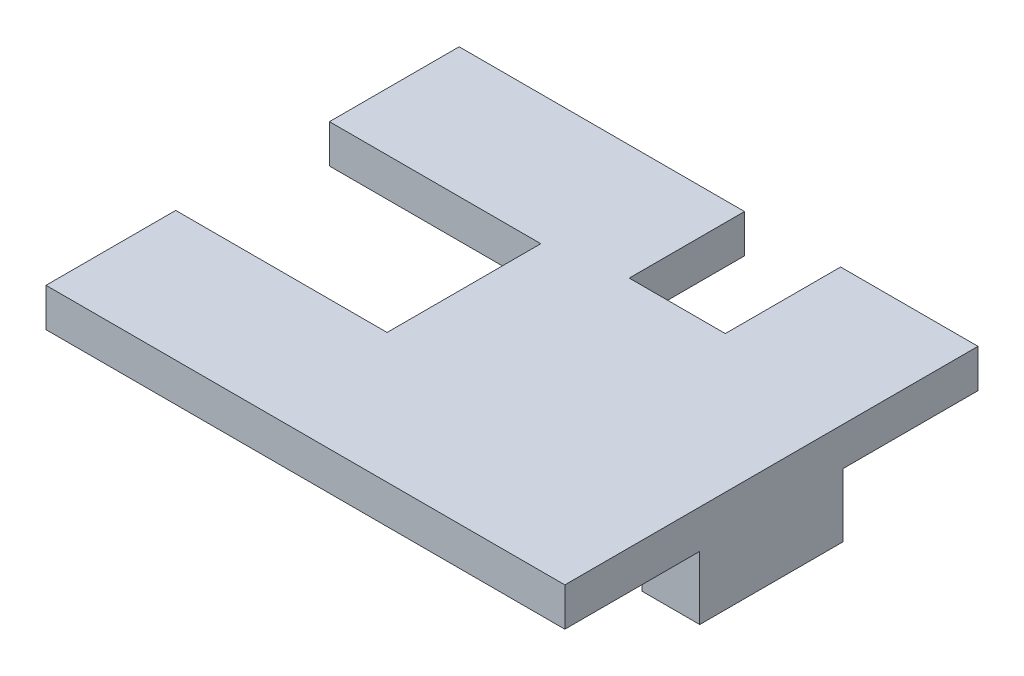
ISO-10303-21;
HEADER;
FILE_DESCRIPTION(('STEP AP214'),'2;1');
FILE_NAME('part.step','',(''),(''),'','','');
FILE_SCHEMA(('AUTOMOTIVE_DESIGN { 1 0 10303 214 1 1 1 1 }'));
ENDSEC;
DATA;
#1=APPLICATION_CONTEXT('core data for automotive mechanical design processes');
#2=APPLICATION_PROTOCOL_DEFINITION('international standard','automotive_design',2000,#1);
#3=PRODUCT_CONTEXT('',#1,'mechanical');
#4=PRODUCT('Part','Part','',(#3));
#5=PRODUCT_RELATED_PRODUCT_CATEGORY('part','',(#4));
#6=PRODUCT_DEFINITION_FORMATION('','',#4);
#7=PRODUCT_DEFINITION_CONTEXT('part definition',#1,'design');
#8=PRODUCT_DEFINITION('design','',#6,#7);
#9=PRODUCT_DEFINITION_SHAPE('','',#8);
#10=(LENGTH_UNIT() NAMED_UNIT(*) SI_UNIT(.MILLI.,.METRE.));
#11=(NAMED_UNIT(*) PLANE_ANGLE_UNIT() SI_UNIT($,.RADIAN.));
#12=(NAMED_UNIT(*) SI_UNIT($,.STERADIAN.) SOLID_ANGLE_UNIT());
#13=UNCERTAINTY_MEASURE_WITH_UNIT(LENGTH_MEASURE(1.E-05),#10,'distance_accuracy_value','');
#14=(GEOMETRIC_REPRESENTATION_CONTEXT(3) GLOBAL_UNCERTAINTY_ASSIGNED_CONTEXT((#13)) GLOBAL_UNIT_ASSIGNED_CONTEXT((#10,
#11,#12)) REPRESENTATION_CONTEXT('',''));
#15=CARTESIAN_POINT('',(0.,0.,0.));
#16=DIRECTION('',(0.,0.,1.));
#17=DIRECTION('',(1.,0.,0.));
#18=AXIS2_PLACEMENT_3D('',#15,#16,#17);
#19=CARTESIAN_POINT('',(0.,0.,0.));
#20=DIRECTION('',(0.,1.,0.));
#21=DIRECTION('',(0.,0.,1.));
#22=AXIS2_PLACEMENT_3D('',#19,#20,#21);
#23=PLANE('',#22);
#24=DIRECTION('',(1.,0.,0.));
#25=VECTOR('',#24,1.);
#26=CARTESIAN_POINT('',(7.96634899281713,0.,-2.94133617535299));
#27=LINE('',#26,#25);
#28=CARTESIAN_POINT('',(4.96634899281713,0.,-2.94133617535299));
#29=VERTEX_POINT('',#28);
#30=CARTESIAN_POINT('',(7.96634899281712,0.,-2.941336175353));
#31=VERTEX_POINT('',#30);
#32=EDGE_CURVE('E50',#29,#31,#27,.T.);
#33=ORIENTED_EDGE('',*,*,#32,.F.);
#34=DIRECTION('',(0.,0.,-1.));
#35=VECTOR('',#34,1.);
#36=CARTESIAN_POINT('',(4.96634899281713,0.,4.518663824647));
#37=LINE('',#36,#35);
#38=CARTESIAN_POINT('',(4.96634899281713,0.,4.518663824647));
#39=VERTEX_POINT('',#38);
#40=EDGE_CURVE('E315',#39,#29,#37,.T.);
#41=ORIENTED_EDGE('',*,*,#40,.F.);
#42=DIRECTION('',(-1.,0.,0.));
#43=VECTOR('',#42,1.);
#44=CARTESIAN_POINT('',(7.96634899281713,0.,4.518663824647));
#45=LINE('',#44,#43);
#46=CARTESIAN_POINT('',(7.96634899281713,0.,4.518663824647));
#47=VERTEX_POINT('',#46);
#48=EDGE_CURVE('E317',#47,#39,#45,.T.);
#49=ORIENTED_EDGE('',*,*,#48,.F.);
#50=DIRECTION('',(0.,0.,-1.));
#51=VECTOR('',#50,1.);
#52=CARTESIAN_POINT('',(7.96634899281712,0.,-9.96133617535299));
#53=LINE('',#52,#51);
#54=CARTESIAN_POINT('',(7.96634899281713,0.,11.538663824647));
#55=VERTEX_POINT('',#54);
#56=EDGE_CURVE('E171',#55,#47,#53,.T.);
#57=ORIENTED_EDGE('',*,*,#56,.F.);
#58=DIRECTION('',(1.,0.,0.));
#59=VECTOR('',#58,1.);
#60=CARTESIAN_POINT('',(-19.0336510071829,0.,11.538663824647));
#61=LINE('',#60,#59);
#62=CARTESIAN_POINT('',(-19.0336510071829,0.,11.538663824647));
#63=VERTEX_POINT('',#62);
#64=EDGE_CURVE('E215',#63,#55,#61,.T.);
#65=ORIENTED_EDGE('',*,*,#64,.F.);
#66=DIRECTION('',(0.,0.,1.));
#67=VECTOR('',#66,1.);
#68=CARTESIAN_POINT('',(-19.0336510071829,0.,4.78866382464701));
#69=LINE('',#68,#67);
#70=CARTESIAN_POINT('',(-19.0336510071829,0.,4.78866382464701));
#71=VERTEX_POINT('',#70);
#72=EDGE_CURVE('E213',#71,#63,#69,.T.);
#73=ORIENTED_EDGE('',*,*,#72,.F.);
#74=DIRECTION('',(-1.,0.,0.));
#75=VECTOR('',#74,1.);
#76=CARTESIAN_POINT('',(-19.0336510071829,0.,4.78866382464701));
#77=LINE('',#76,#75);
#78=CARTESIAN_POINT('',(-8.03365100718288,0.,4.78866382464701));
#79=VERTEX_POINT('',#78);
#80=EDGE_CURVE('E211',#79,#71,#77,.T.);
#81=ORIENTED_EDGE('',*,*,#80,.F.);
#82=DIRECTION('',(0.,0.,1.));
#83=VECTOR('',#82,1.);
#84=CARTESIAN_POINT('',(-8.03365100718288,0.,-3.21133617535299));
#85=LINE('',#84,#83);
#86=CARTESIAN_POINT('',(-8.03365100718288,0.,-3.21133617535299));
#87=VERTEX_POINT('',#86);
#88=EDGE_CURVE('E209',#87,#79,#85,.T.);
#89=ORIENTED_EDGE('',*,*,#88,.F.);
#90=DIRECTION('',(1.,0.,0.));
#91=VECTOR('',#90,1.);
#92=CARTESIAN_POINT('',(-19.0336510071829,0.,-3.21133617535299));
#93=LINE('',#92,#91);
#94=CARTESIAN_POINT('',(-19.0336510071829,0.,-3.21133617535299));
#95=VERTEX_POINT('',#94);
#96=EDGE_CURVE('E175',#95,#87,#93,.T.);
#97=ORIENTED_EDGE('',*,*,#96,.F.);
#98=DIRECTION('',(0.,0.,1.));
#99=VECTOR('',#98,1.);
#100=CARTESIAN_POINT('',(-19.0336510071829,0.,-9.96133617535299));
#101=LINE('',#100,#99);
#102=CARTESIAN_POINT('',(-19.0336510071829,0.,-9.96133617535299));
#103=VERTEX_POINT('',#102);
#104=EDGE_CURVE('E172',#103,#95,#101,.T.);
#105=ORIENTED_EDGE('',*,*,#104,.F.);
#106=DIRECTION('',(-1.,0.,0.));
#107=VECTOR('',#106,1.);
#108=CARTESIAN_POINT('',(-19.0336510071829,0.,-9.96133617535299));
#109=LINE('',#108,#107);
#110=CARTESIAN_POINT('',(-4.18365100718288,0.,-9.96133617535299));
#111=VERTEX_POINT('',#110);
#112=EDGE_CURVE('E185',#111,#103,#109,.T.);
#113=ORIENTED_EDGE('',*,*,#112,.F.);
#114=DIRECTION('',(0.,0.,-1.));
#115=VECTOR('',#114,1.);
#116=CARTESIAN_POINT('',(-4.18365100718288,0.,-9.96133617535299));
#117=LINE('',#116,#115);
#118=CARTESIAN_POINT('',(-4.18365100718288,0.,-3.96133617535299));
#119=VERTEX_POINT('',#118);
#120=EDGE_CURVE('E224',#119,#111,#117,.T.);
#121=ORIENTED_EDGE('',*,*,#120,.F.);
#122=DIRECTION('',(-1.,0.,0.));
#123=VECTOR('',#122,1.);
#124=CARTESIAN_POINT('',(-4.18365100718288,0.,-3.96133617535299));
#125=LINE('',#124,#123);
#126=CARTESIAN_POINT('',(0.816348992817122,0.,-3.96133617535299));
#127=VERTEX_POINT('',#126);
#128=EDGE_CURVE('E222',#127,#119,#125,.T.);
#129=ORIENTED_EDGE('',*,*,#128,.F.);
#130=DIRECTION('',(0.,0.,1.));
#131=VECTOR('',#130,1.);
#132=CARTESIAN_POINT('',(0.816348992817122,0.,-9.96133617535299));
#133=LINE('',#132,#131);
#134=CARTESIAN_POINT('',(0.816348992817122,0.,-9.96133617535299));
#135=VERTEX_POINT('',#134);
#136=EDGE_CURVE('E220',#135,#127,#133,.T.);
#137=ORIENTED_EDGE('',*,*,#136,.F.);
#138=DIRECTION('',(-1.,0.,0.));
#139=VECTOR('',#138,1.);
#140=CARTESIAN_POINT('',(0.816348992817122,0.,-9.96133617535299));
#141=LINE('',#140,#139);
#142=CARTESIAN_POINT('',(7.96634899281712,0.,-9.96133617535299));
#143=VERTEX_POINT('',#142);
#144=EDGE_CURVE('E218',#143,#135,#141,.T.);
#145=ORIENTED_EDGE('',*,*,#144,.F.);
#146=EDGE_CURVE('E55',#31,#143,#53,.T.);
#147=ORIENTED_EDGE('',*,*,#146,.F.);
#148=EDGE_LOOP('',(#33,#41,#49,#57,#65,#73,#81,#89,#97,#105,#113,#121,#129,#137,#145,#147));
#149=FACE_BOUND('',#148,.T.);
#150=ADVANCED_FACE('F35',(#149),#23,.F.);
#151=CARTESIAN_POINT('',(-19.0336510071829,2.,-9.96133617535299));
#152=DIRECTION('',(1.,0.,0.));
#153=DIRECTION('',(0.,0.,-1.));
#154=AXIS2_PLACEMENT_3D('',#151,#152,#153);
#155=PLANE('',#154);
#156=ORIENTED_EDGE('',*,*,#104,.T.);
#157=DIRECTION('',(0.,-1.,0.));
#158=VECTOR('',#157,1.);
#159=CARTESIAN_POINT('',(-19.0336510071829,2.,-3.21133617535299));
#160=LINE('',#159,#158);
#161=CARTESIAN_POINT('',(-19.0336510071829,2.,-3.21133617535299));
#162=VERTEX_POINT('',#161);
#163=EDGE_CURVE('E11',#162,#95,#160,.T.);
#164=ORIENTED_EDGE('',*,*,#163,.F.);
#165=DIRECTION('',(0.,0.,1.));
#166=VECTOR('',#165,1.);
#167=CARTESIAN_POINT('',(-19.0336510071829,2.,-9.96133617535299));
#168=LINE('',#167,#166);
#169=CARTESIAN_POINT('',(-19.0336510071829,2.,-9.96133617535299));
#170=VERTEX_POINT('',#169);
#171=EDGE_CURVE('E181',#170,#162,#168,.T.);
#172=ORIENTED_EDGE('',*,*,#171,.F.);
#173=DIRECTION('',(0.,-1.,0.));
#174=VECTOR('',#173,1.);
#175=CARTESIAN_POINT('',(-19.0336510071829,2.,-9.96133617535299));
#176=LINE('',#175,#174);
#177=EDGE_CURVE('E206',#170,#103,#176,.T.);
#178=ORIENTED_EDGE('',*,*,#177,.T.);
#179=EDGE_LOOP('',(#156,#164,#172,#178));
#180=FACE_BOUND('',#179,.T.);
#181=ADVANCED_FACE('F37',(#180),#155,.F.);
#182=CARTESIAN_POINT('',(-19.0336510071829,2.,-3.21133617535299));
#183=DIRECTION('',(0.,0.,-1.));
#184=DIRECTION('',(-1.,0.,0.));
#185=AXIS2_PLACEMENT_3D('',#182,#183,#184);
#186=PLANE('',#185);
#187=ORIENTED_EDGE('',*,*,#96,.T.);
#188=DIRECTION('',(0.,-1.,0.));
#189=VECTOR('',#188,1.);
#190=CARTESIAN_POINT('',(-8.03365100718288,2.,-3.21133617535299));
#191=LINE('',#190,#189);
#192=CARTESIAN_POINT('',(-8.03365100718288,2.,-3.21133617535299));
#193=VERTEX_POINT('',#192);
#194=EDGE_CURVE('E43',#193,#87,#191,.T.);
#195=ORIENTED_EDGE('',*,*,#194,.F.);
#196=DIRECTION('',(1.,0.,0.));
#197=VECTOR('',#196,1.);
#198=CARTESIAN_POINT('',(-19.0336510071829,2.,-3.21133617535299));
#199=LINE('',#198,#197);
#200=EDGE_CURVE('E184',#162,#193,#199,.T.);
#201=ORIENTED_EDGE('',*,*,#200,.F.);
#202=ORIENTED_EDGE('',*,*,#163,.T.);
#203=EDGE_LOOP('',(#187,#195,#201,#202));
#204=FACE_BOUND('',#203,.T.);
#205=ADVANCED_FACE('F280',(#204),#186,.F.);
#206=CARTESIAN_POINT('',(-8.03365100718288,2.,-3.21133617535299));
#207=DIRECTION('',(1.,0.,0.));
#208=DIRECTION('',(0.,0.,-1.));
#209=AXIS2_PLACEMENT_3D('',#206,#207,#208);
#210=PLANE('',#209);
#211=ORIENTED_EDGE('',*,*,#88,.T.);
#212=DIRECTION('',(0.,-1.,0.));
#213=VECTOR('',#212,1.);
#214=CARTESIAN_POINT('',(-8.03365100718288,2.,4.78866382464701));
#215=LINE('',#214,#213);
#216=CARTESIAN_POINT('',(-8.03365100718288,2.,4.78866382464701));
#217=VERTEX_POINT('',#216);
#218=EDGE_CURVE('E252',#217,#79,#215,.T.);
#219=ORIENTED_EDGE('',*,*,#218,.F.);
#220=DIRECTION('',(0.,0.,1.));
#221=VECTOR('',#220,1.);
#222=CARTESIAN_POINT('',(-8.03365100718288,2.,-3.21133617535299));
#223=LINE('',#222,#221);
#224=EDGE_CURVE('E187',#193,#217,#223,.T.);
#225=ORIENTED_EDGE('',*,*,#224,.F.);
#226=ORIENTED_EDGE('',*,*,#194,.T.);
#227=EDGE_LOOP('',(#211,#219,#225,#226));
#228=FACE_BOUND('',#227,.T.);
#229=ADVANCED_FACE('F259',(#228),#210,.F.);
#230=CARTESIAN_POINT('',(-19.0336510071829,2.,4.78866382464701));
#231=DIRECTION('',(0.,0.,1.));
#232=DIRECTION('',(1.,0.,0.));
#233=AXIS2_PLACEMENT_3D('',#230,#231,#232);
#234=PLANE('',#233);
#235=ORIENTED_EDGE('',*,*,#80,.T.);
#236=DIRECTION('',(0.,-1.,0.));
#237=VECTOR('',#236,1.);
#238=CARTESIAN_POINT('',(-19.0336510071829,2.,4.78866382464701));
#239=LINE('',#238,#237);
#240=CARTESIAN_POINT('',(-19.0336510071829,2.,4.78866382464701));
#241=VERTEX_POINT('',#240);
#242=EDGE_CURVE('E249',#241,#71,#239,.T.);
#243=ORIENTED_EDGE('',*,*,#242,.F.);
#244=DIRECTION('',(-1.,0.,0.));
#245=VECTOR('',#244,1.);
#246=CARTESIAN_POINT('',(-19.0336510071829,2.,4.78866382464701));
#247=LINE('',#246,#245);
#248=EDGE_CURVE('E189',#217,#241,#247,.T.);
#249=ORIENTED_EDGE('',*,*,#248,.F.);
#250=ORIENTED_EDGE('',*,*,#218,.T.);
#251=EDGE_LOOP('',(#235,#243,#249,#250));
#252=FACE_BOUND('',#251,.T.);
#253=ADVANCED_FACE('F268',(#252),#234,.F.);
#254=CARTESIAN_POINT('',(-19.0336510071829,2.,4.78866382464701));
#255=DIRECTION('',(1.,0.,0.));
#256=DIRECTION('',(0.,0.,-1.));
#257=AXIS2_PLACEMENT_3D('',#254,#255,#256);
#258=PLANE('',#257);
#259=ORIENTED_EDGE('',*,*,#72,.T.);
#260=DIRECTION('',(0.,-1.,0.));
#261=VECTOR('',#260,1.);
#262=CARTESIAN_POINT('',(-19.0336510071829,2.,11.538663824647));
#263=LINE('',#262,#261);
#264=CARTESIAN_POINT('',(-19.0336510071829,2.,11.538663824647));
#265=VERTEX_POINT('',#264);
#266=EDGE_CURVE('E246',#265,#63,#263,.T.);
#267=ORIENTED_EDGE('',*,*,#266,.F.);
#268=DIRECTION('',(0.,0.,1.));
#269=VECTOR('',#268,1.);
#270=CARTESIAN_POINT('',(-19.0336510071829,2.,4.78866382464701));
#271=LINE('',#270,#269);
#272=EDGE_CURVE('E191',#241,#265,#271,.T.);
#273=ORIENTED_EDGE('',*,*,#272,.F.);
#274=ORIENTED_EDGE('',*,*,#242,.T.);
#275=EDGE_LOOP('',(#259,#267,#273,#274));
#276=FACE_BOUND('',#275,.T.);
#277=ADVANCED_FACE('F272',(#276),#258,.F.);
#278=CARTESIAN_POINT('',(-19.0336510071829,2.,11.538663824647));
#279=DIRECTION('',(0.,0.,-1.));
#280=DIRECTION('',(-1.,0.,0.));
#281=AXIS2_PLACEMENT_3D('',#278,#279,#280);
#282=PLANE('',#281);
#283=ORIENTED_EDGE('',*,*,#64,.T.);
#284=DIRECTION('',(0.,-1.,0.));
#285=VECTOR('',#284,1.);
#286=CARTESIAN_POINT('',(7.96634899281713,2.,11.538663824647));
#287=LINE('',#286,#285);
#288=CARTESIAN_POINT('',(7.96634899281713,2.,11.538663824647));
#289=VERTEX_POINT('',#288);
#290=EDGE_CURVE('E244',#289,#55,#287,.T.);
#291=ORIENTED_EDGE('',*,*,#290,.F.);
#292=DIRECTION('',(1.,0.,0.));
#293=VECTOR('',#292,1.);
#294=CARTESIAN_POINT('',(-19.0336510071829,2.,11.538663824647));
#295=LINE('',#294,#293);
#296=EDGE_CURVE('E193',#265,#289,#295,.T.);
#297=ORIENTED_EDGE('',*,*,#296,.F.);
#298=ORIENTED_EDGE('',*,*,#266,.T.);
#299=EDGE_LOOP('',(#283,#291,#297,#298));
#300=FACE_BOUND('',#299,.T.);
#301=ADVANCED_FACE('F351',(#300),#282,.F.);
#302=CARTESIAN_POINT('',(7.96634899281712,2.,-9.96133617535299));
#303=DIRECTION('',(-1.,0.,0.));
#304=DIRECTION('',(0.,0.,1.));
#305=AXIS2_PLACEMENT_3D('',#302,#303,#304);
#306=PLANE('',#305);
#307=ORIENTED_EDGE('',*,*,#56,.T.);
#308=DIRECTION('',(0.,1.,0.));
#309=VECTOR('',#308,1.);
#310=CARTESIAN_POINT('',(7.96634899281713,-3.3,4.518663824647));
#311=LINE('',#310,#309);
#312=CARTESIAN_POINT('',(7.96634899281713,-3.3,4.518663824647));
#313=VERTEX_POINT('',#312);
#314=EDGE_CURVE('E151',#313,#47,#311,.T.);
#315=ORIENTED_EDGE('',*,*,#314,.F.);
#316=DIRECTION('',(0.,0.,1.));
#317=VECTOR('',#316,1.);
#318=CARTESIAN_POINT('',(7.96634899281713,-3.3,4.518663824647));
#319=LINE('',#318,#317);
#320=CARTESIAN_POINT('',(7.96634899281713,-3.3,-2.94133617535299));
#321=VERTEX_POINT('',#320);
#322=EDGE_CURVE('E157',#321,#313,#319,.T.);
#323=ORIENTED_EDGE('',*,*,#322,.F.);
#324=DIRECTION('',(0.,1.,0.));
#325=VECTOR('',#324,1.);
#326=CARTESIAN_POINT('',(7.96634899281713,-3.3,-2.94133617535299));
#327=LINE('',#326,#325);
#328=EDGE_CURVE('E308',#321,#31,#327,.T.);
#329=ORIENTED_EDGE('',*,*,#328,.T.);
#330=ORIENTED_EDGE('',*,*,#146,.T.);
#331=DIRECTION('',(0.,-1.,0.));
#332=VECTOR('',#331,1.);
#333=CARTESIAN_POINT('',(7.96634899281712,2.,-9.96133617535299));
#334=LINE('',#333,#332);
#335=CARTESIAN_POINT('',(7.96634899281712,2.,-9.96133617535299));
#336=VERTEX_POINT('',#335);
#337=EDGE_CURVE('E241',#336,#143,#334,.T.);
#338=ORIENTED_EDGE('',*,*,#337,.F.);
#339=DIRECTION('',(0.,0.,-1.));
#340=VECTOR('',#339,1.);
#341=CARTESIAN_POINT('',(7.96634899281712,2.,-9.96133617535299));
#342=LINE('',#341,#340);
#343=EDGE_CURVE('E195',#289,#336,#342,.T.);
#344=ORIENTED_EDGE('',*,*,#343,.F.);
#345=ORIENTED_EDGE('',*,*,#290,.T.);
#346=EDGE_LOOP('',(#307,#315,#323,#329,#330,#338,#344,#345));
#347=FACE_BOUND('',#346,.T.);
#348=ADVANCED_FACE('F168',(#347),#306,.F.);
#349=CARTESIAN_POINT('',(0.816348992817122,2.,-9.96133617535299));
#350=DIRECTION('',(0.,0.,1.));
#351=DIRECTION('',(1.,0.,0.));
#352=AXIS2_PLACEMENT_3D('',#349,#350,#351);
#353=PLANE('',#352);
#354=ORIENTED_EDGE('',*,*,#144,.T.);
#355=DIRECTION('',(0.,-1.,0.));
#356=VECTOR('',#355,1.);
#357=CARTESIAN_POINT('',(0.816348992817122,2.,-9.96133617535299));
#358=LINE('',#357,#356);
#359=CARTESIAN_POINT('',(0.816348992817122,2.,-9.96133617535299));
#360=VERTEX_POINT('',#359);
#361=EDGE_CURVE('E238',#360,#135,#358,.T.);
#362=ORIENTED_EDGE('',*,*,#361,.F.);
#363=DIRECTION('',(-1.,0.,0.));
#364=VECTOR('',#363,1.);
#365=CARTESIAN_POINT('',(0.816348992817122,2.,-9.96133617535299));
#366=LINE('',#365,#364);
#367=EDGE_CURVE('E197',#336,#360,#366,.T.);
#368=ORIENTED_EDGE('',*,*,#367,.F.);
#369=ORIENTED_EDGE('',*,*,#337,.T.);
#370=EDGE_LOOP('',(#354,#362,#368,#369));
#371=FACE_BOUND('',#370,.T.);
#372=ADVANCED_FACE('F305',(#371),#353,.F.);
#373=CARTESIAN_POINT('',(0.816348992817122,2.,-9.96133617535299));
#374=DIRECTION('',(1.,0.,0.));
#375=DIRECTION('',(0.,0.,-1.));
#376=AXIS2_PLACEMENT_3D('',#373,#374,#375);
#377=PLANE('',#376);
#378=ORIENTED_EDGE('',*,*,#136,.T.);
#379=DIRECTION('',(0.,-1.,0.));
#380=VECTOR('',#379,1.);
#381=CARTESIAN_POINT('',(0.816348992817122,2.,-3.96133617535299));
#382=LINE('',#381,#380);
#383=CARTESIAN_POINT('',(0.816348992817122,2.,-3.96133617535299));
#384=VERTEX_POINT('',#383);
#385=EDGE_CURVE('E235',#384,#127,#382,.T.);
#386=ORIENTED_EDGE('',*,*,#385,.F.);
#387=DIRECTION('',(0.,0.,1.));
#388=VECTOR('',#387,1.);
#389=CARTESIAN_POINT('',(0.816348992817122,2.,-9.96133617535299));
#390=LINE('',#389,#388);
#391=EDGE_CURVE('E199',#360,#384,#390,.T.);
#392=ORIENTED_EDGE('',*,*,#391,.F.);
#393=ORIENTED_EDGE('',*,*,#361,.T.);
#394=EDGE_LOOP('',(#378,#386,#392,#393));
#395=FACE_BOUND('',#394,.T.);
#396=ADVANCED_FACE('F300',(#395),#377,.F.);
#397=CARTESIAN_POINT('',(-4.18365100718288,2.,-3.96133617535299));
#398=DIRECTION('',(0.,0.,1.));
#399=DIRECTION('',(1.,0.,0.));
#400=AXIS2_PLACEMENT_3D('',#397,#398,#399);
#401=PLANE('',#400);
#402=ORIENTED_EDGE('',*,*,#128,.T.);
#403=DIRECTION('',(0.,-1.,0.));
#404=VECTOR('',#403,1.);
#405=CARTESIAN_POINT('',(-4.18365100718288,2.,-3.96133617535299));
#406=LINE('',#405,#404);
#407=CARTESIAN_POINT('',(-4.18365100718288,2.,-3.96133617535299));
#408=VERTEX_POINT('',#407);
#409=EDGE_CURVE('E232',#408,#119,#406,.T.);
#410=ORIENTED_EDGE('',*,*,#409,.F.);
#411=DIRECTION('',(-1.,0.,0.));
#412=VECTOR('',#411,1.);
#413=CARTESIAN_POINT('',(-4.18365100718288,2.,-3.96133617535299));
#414=LINE('',#413,#412);
#415=EDGE_CURVE('E201',#384,#408,#414,.T.);
#416=ORIENTED_EDGE('',*,*,#415,.F.);
#417=ORIENTED_EDGE('',*,*,#385,.T.);
#418=EDGE_LOOP('',(#402,#410,#416,#417));
#419=FACE_BOUND('',#418,.T.);
#420=ADVANCED_FACE('F296',(#419),#401,.F.);
#421=CARTESIAN_POINT('',(-4.18365100718288,2.,-9.96133617535299));
#422=DIRECTION('',(-1.,0.,0.));
#423=DIRECTION('',(0.,0.,1.));
#424=AXIS2_PLACEMENT_3D('',#421,#422,#423);
#425=PLANE('',#424);
#426=ORIENTED_EDGE('',*,*,#120,.T.);
#427=DIRECTION('',(0.,-1.,0.));
#428=VECTOR('',#427,1.);
#429=CARTESIAN_POINT('',(-4.18365100718288,2.,-9.96133617535299));
#430=LINE('',#429,#428);
#431=CARTESIAN_POINT('',(-4.18365100718288,2.,-9.96133617535299));
#432=VERTEX_POINT('',#431);
#433=EDGE_CURVE('E229',#432,#111,#430,.T.);
#434=ORIENTED_EDGE('',*,*,#433,.F.);
#435=DIRECTION('',(0.,0.,-1.));
#436=VECTOR('',#435,1.);
#437=CARTESIAN_POINT('',(-4.18365100718288,2.,-9.96133617535299));
#438=LINE('',#437,#436);
#439=EDGE_CURVE('E203',#408,#432,#438,.T.);
#440=ORIENTED_EDGE('',*,*,#439,.F.);
#441=ORIENTED_EDGE('',*,*,#409,.T.);
#442=EDGE_LOOP('',(#426,#434,#440,#441));
#443=FACE_BOUND('',#442,.T.);
#444=ADVANCED_FACE('F292',(#443),#425,.F.);
#445=CARTESIAN_POINT('',(-19.0336510071829,2.,-9.96133617535299));
#446=DIRECTION('',(0.,0.,1.));
#447=DIRECTION('',(1.,0.,0.));
#448=AXIS2_PLACEMENT_3D('',#445,#446,#447);
#449=PLANE('',#448);
#450=ORIENTED_EDGE('',*,*,#112,.T.);
#451=ORIENTED_EDGE('',*,*,#177,.F.);
#452=DIRECTION('',(-1.,0.,0.));
#453=VECTOR('',#452,1.);
#454=CARTESIAN_POINT('',(-19.0336510071829,2.,-9.96133617535299));
#455=LINE('',#454,#453);
#456=EDGE_CURVE('E205',#432,#170,#455,.T.);
#457=ORIENTED_EDGE('',*,*,#456,.F.);
#458=ORIENTED_EDGE('',*,*,#433,.T.);
#459=EDGE_LOOP('',(#450,#451,#457,#458));
#460=FACE_BOUND('',#459,.T.);
#461=ADVANCED_FACE('F287',(#460),#449,.F.);
#462=CARTESIAN_POINT('',(0.,2.,0.));
#463=DIRECTION('',(0.,1.,0.));
#464=DIRECTION('',(0.,0.,1.));
#465=AXIS2_PLACEMENT_3D('',#462,#463,#464);
#466=PLANE('',#465);
#467=ORIENTED_EDGE('',*,*,#171,.T.);
#468=ORIENTED_EDGE('',*,*,#200,.T.);
#469=ORIENTED_EDGE('',*,*,#224,.T.);
#470=ORIENTED_EDGE('',*,*,#248,.T.);
#471=ORIENTED_EDGE('',*,*,#272,.T.);
#472=ORIENTED_EDGE('',*,*,#296,.T.);
#473=ORIENTED_EDGE('',*,*,#343,.T.);
#474=ORIENTED_EDGE('',*,*,#367,.T.);
#475=ORIENTED_EDGE('',*,*,#391,.T.);
#476=ORIENTED_EDGE('',*,*,#415,.T.);
#477=ORIENTED_EDGE('',*,*,#439,.T.);
#478=ORIENTED_EDGE('',*,*,#456,.T.);
#479=EDGE_LOOP('',(#467,#468,#469,#470,#471,#472,#473,#474,#475,#476,#477,#478));
#480=FACE_BOUND('',#479,.T.);
#481=ADVANCED_FACE('F276',(#480),#466,.T.);
#482=CARTESIAN_POINT('',(7.96634899281713,-3.3,4.518663824647));
#483=DIRECTION('',(0.,0.,-1.));
#484=DIRECTION('',(-1.,0.,0.));
#485=AXIS2_PLACEMENT_3D('',#482,#483,#484);
#486=PLANE('',#485);
#487=ORIENTED_EDGE('',*,*,#48,.T.);
#488=DIRECTION('',(0.,1.,0.));
#489=VECTOR('',#488,1.);
#490=CARTESIAN_POINT('',(4.96634899281713,-3.3,4.518663824647));
#491=LINE('',#490,#489);
#492=CARTESIAN_POINT('',(4.96634899281713,-3.3,4.518663824647));
#493=VERTEX_POINT('',#492);
#494=EDGE_CURVE('E153',#493,#39,#491,.T.);
#495=ORIENTED_EDGE('',*,*,#494,.F.);
#496=DIRECTION('',(-1.,0.,0.));
#497=VECTOR('',#496,1.);
#498=CARTESIAN_POINT('',(7.96634899281713,-3.3,4.518663824647));
#499=LINE('',#498,#497);
#500=EDGE_CURVE('E146',#313,#493,#499,.T.);
#501=ORIENTED_EDGE('',*,*,#500,.F.);
#502=ORIENTED_EDGE('',*,*,#314,.T.);
#503=EDGE_LOOP('',(#487,#495,#501,#502));
#504=FACE_BOUND('',#503,.T.);
#505=ADVANCED_FACE('F149',(#504),#486,.F.);
#506=CARTESIAN_POINT('',(4.96634899281713,-3.3,4.518663824647));
#507=DIRECTION('',(1.,0.,0.));
#508=DIRECTION('',(0.,0.,-1.));
#509=AXIS2_PLACEMENT_3D('',#506,#507,#508);
#510=PLANE('',#509);
#511=ORIENTED_EDGE('',*,*,#40,.T.);
#512=DIRECTION('',(0.,1.,0.));
#513=VECTOR('',#512,1.);
#514=CARTESIAN_POINT('',(4.96634899281713,-3.3,-2.94133617535299));
#515=LINE('',#514,#513);
#516=CARTESIAN_POINT('',(4.96634899281713,-3.3,-2.94133617535299));
#517=VERTEX_POINT('',#516);
#518=EDGE_CURVE('E177',#517,#29,#515,.T.);
#519=ORIENTED_EDGE('',*,*,#518,.F.);
#520=DIRECTION('',(0.,0.,-1.));
#521=VECTOR('',#520,1.);
#522=CARTESIAN_POINT('',(4.96634899281713,-3.3,4.518663824647));
#523=LINE('',#522,#521);
#524=EDGE_CURVE('E156',#493,#517,#523,.T.);
#525=ORIENTED_EDGE('',*,*,#524,.F.);
#526=ORIENTED_EDGE('',*,*,#494,.T.);
#527=EDGE_LOOP('',(#511,#519,#525,#526));
#528=FACE_BOUND('',#527,.T.);
#529=ADVANCED_FACE('F321',(#528),#510,.F.);
#530=CARTESIAN_POINT('',(7.96634899281713,-3.3,-2.94133617535299));
#531=DIRECTION('',(0.,0.,1.));
#532=DIRECTION('',(1.,0.,0.));
#533=AXIS2_PLACEMENT_3D('',#530,#531,#532);
#534=PLANE('',#533);
#535=ORIENTED_EDGE('',*,*,#32,.T.);
#536=ORIENTED_EDGE('',*,*,#328,.F.);
#537=DIRECTION('',(1.,0.,0.));
#538=VECTOR('',#537,1.);
#539=CARTESIAN_POINT('',(7.96634899281713,-3.3,-2.94133617535299));
#540=LINE('',#539,#538);
#541=EDGE_CURVE('E162',#517,#321,#540,.T.);
#542=ORIENTED_EDGE('',*,*,#541,.F.);
#543=ORIENTED_EDGE('',*,*,#518,.T.);
#544=EDGE_LOOP('',(#535,#536,#542,#543));
#545=FACE_BOUND('',#544,.T.);
#546=ADVANCED_FACE('F322',(#545),#534,.F.);
#547=CARTESIAN_POINT('',(0.,-3.3,0.));
#548=DIRECTION('',(0.,1.,0.));
#549=DIRECTION('',(0.,0.,1.));
#550=AXIS2_PLACEMENT_3D('',#547,#548,#549);
#551=PLANE('',#550);
#552=ORIENTED_EDGE('',*,*,#322,.T.);
#553=ORIENTED_EDGE('',*,*,#500,.T.);
#554=ORIENTED_EDGE('',*,*,#524,.T.);
#555=ORIENTED_EDGE('',*,*,#541,.T.);
#556=EDGE_LOOP('',(#552,#553,#554,#555));
#557=FACE_BOUND('',#556,.T.);
#558=ADVANCED_FACE('F160',(#557),#551,.F.);
#559=CLOSED_SHELL('',(#150,#181,#205,#229,#253,#277,#301,#348,#372,#396,#420,#444,#461,#481,
#505,#529,#546,#558));
#560=MANIFOLD_SOLID_BREP('B2',#559);
#561=ADVANCED_BREP_SHAPE_REPRESENTATION('',(#18,#560),#14);
#562=SHAPE_DEFINITION_REPRESENTATION(#9,#561);
ENDSEC;
END-ISO-10303-21;
